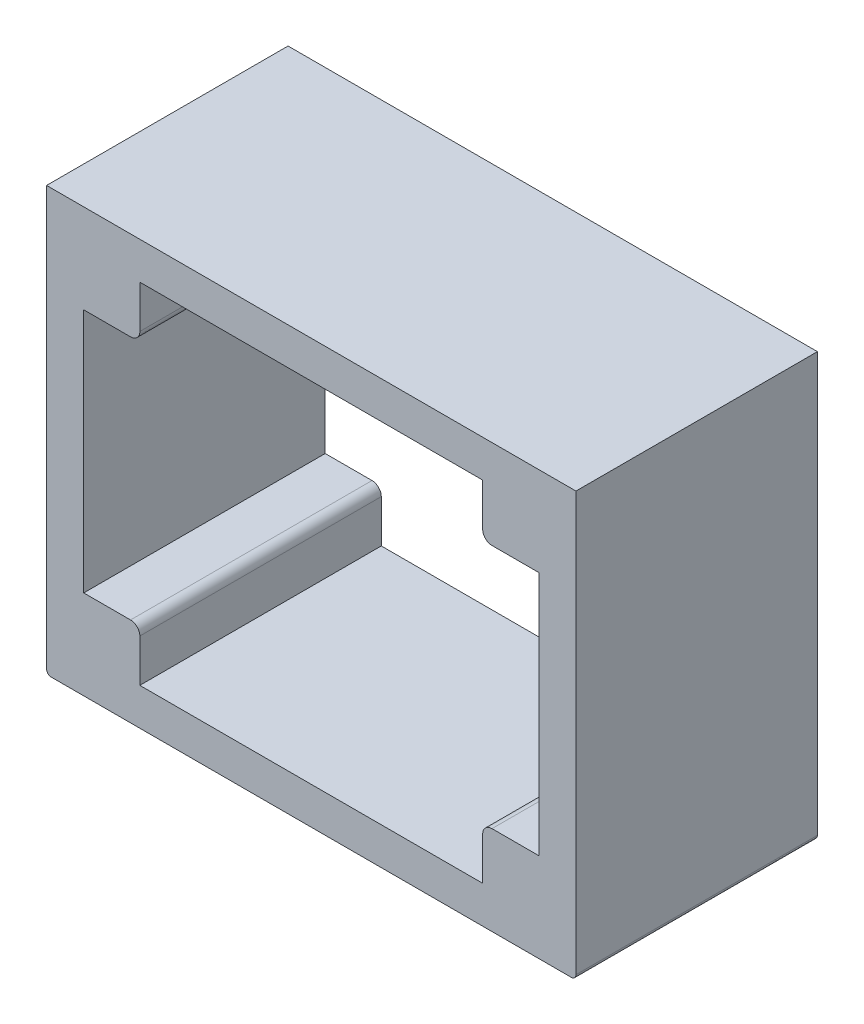
ISO-10303-21;
HEADER;
FILE_DESCRIPTION(('STEP AP214'),'2;1');
FILE_NAME('part.step','',(''),(''),'','','');
FILE_SCHEMA(('AUTOMOTIVE_DESIGN { 1 0 10303 214 1 1 1 1 }'));
ENDSEC;
DATA;
#1=APPLICATION_CONTEXT('core data for automotive mechanical design processes');
#2=APPLICATION_PROTOCOL_DEFINITION('international standard','automotive_design',2000,#1);
#3=PRODUCT_CONTEXT('',#1,'mechanical');
#4=PRODUCT('Part','Part','',(#3));
#5=PRODUCT_RELATED_PRODUCT_CATEGORY('part','',(#4));
#6=PRODUCT_DEFINITION_FORMATION('','',#4);
#7=PRODUCT_DEFINITION_CONTEXT('part definition',#1,'design');
#8=PRODUCT_DEFINITION('design','',#6,#7);
#9=PRODUCT_DEFINITION_SHAPE('','',#8);
#10=(LENGTH_UNIT() NAMED_UNIT(*) SI_UNIT(.MILLI.,.METRE.));
#11=(NAMED_UNIT(*) PLANE_ANGLE_UNIT() SI_UNIT($,.RADIAN.));
#12=(NAMED_UNIT(*) SI_UNIT($,.STERADIAN.) SOLID_ANGLE_UNIT());
#13=UNCERTAINTY_MEASURE_WITH_UNIT(LENGTH_MEASURE(1.E-05),#10,'distance_accuracy_value','');
#14=(GEOMETRIC_REPRESENTATION_CONTEXT(3) GLOBAL_UNCERTAINTY_ASSIGNED_CONTEXT((#13)) GLOBAL_UNIT_ASSIGNED_CONTEXT((#10,
#11,#12)) REPRESENTATION_CONTEXT('',''));
#15=CARTESIAN_POINT('',(0.,0.,0.));
#16=DIRECTION('',(0.,0.,1.));
#17=DIRECTION('',(1.,0.,0.));
#18=AXIS2_PLACEMENT_3D('',#15,#16,#17);
#19=CARTESIAN_POINT('',(-4.88949999999998,-143.192499999999,82.55));
#20=DIRECTION('',(0.,0.,1.));
#21=DIRECTION('',(1.,0.,0.));
#22=AXIS2_PLACEMENT_3D('',#19,#20,#21);
#23=PLANE('',#22);
#24=DIRECTION('',(0.,-1.,0.));
#25=VECTOR('',#24,1.);
#26=CARTESIAN_POINT('',(-6.47699999999994,1.01592686356331E-13,82.55));
#27=LINE('',#26,#25);
#28=CARTESIAN_POINT('',(-6.47699999999994,1.01592686356331E-13,82.55));
#29=VERTEX_POINT('',#28);
#30=CARTESIAN_POINT('',(-6.47699999999997,-143.192499999999,82.55));
#31=VERTEX_POINT('',#30);
#32=EDGE_CURVE('E332',#29,#31,#27,.T.);
#33=ORIENTED_EDGE('',*,*,#32,.T.);
#34=CARTESIAN_POINT('',(-4.88949999999998,-143.192499999999,82.55));
#35=DIRECTION('',(0.,0.,1.));
#36=DIRECTION('',(1.,0.,0.));
#37=AXIS2_PLACEMENT_3D('',#34,#35,#36);
#38=CIRCLE('',#37,1.58749999999999);
#39=CARTESIAN_POINT('',(-4.88949999999998,-144.779999999999,82.55));
#40=VERTEX_POINT('',#39);
#41=EDGE_CURVE('E336',#31,#40,#38,.T.);
#42=ORIENTED_EDGE('',*,*,#41,.T.);
#43=DIRECTION('',(1.,0.,0.));
#44=VECTOR('',#43,1.);
#45=CARTESIAN_POINT('',(-4.88949999999998,-144.779999999999,82.55));
#46=LINE('',#45,#44);
#47=CARTESIAN_POINT('',(172.9105,-144.779999999999,82.55));
#48=VERTEX_POINT('',#47);
#49=EDGE_CURVE('E339',#40,#48,#46,.T.);
#50=ORIENTED_EDGE('',*,*,#49,.T.);
#51=CARTESIAN_POINT('',(172.9105,-143.192499999999,82.55));
#52=DIRECTION('',(0.,0.,1.));
#53=DIRECTION('',(1.,0.,0.));
#54=AXIS2_PLACEMENT_3D('',#51,#52,#53);
#55=CIRCLE('',#54,1.58750000000001);
#56=CARTESIAN_POINT('',(174.498,-143.192499999999,82.55));
#57=VERTEX_POINT('',#56);
#58=EDGE_CURVE('E341',#48,#57,#55,.T.);
#59=ORIENTED_EDGE('',*,*,#58,.T.);
#60=DIRECTION('',(0.,1.,0.));
#61=VECTOR('',#60,1.);
#62=CARTESIAN_POINT('',(174.498,-143.192499999999,82.55));
#63=LINE('',#62,#61);
#64=CARTESIAN_POINT('',(174.498,1.04950770296597E-13,82.55));
#65=VERTEX_POINT('',#64);
#66=EDGE_CURVE('E343',#57,#65,#63,.T.);
#67=ORIENTED_EDGE('',*,*,#66,.T.);
#68=DIRECTION('',(-1.,0.,0.));
#69=VECTOR('',#68,1.);
#70=CARTESIAN_POINT('',(174.498,1.04950770296597E-13,82.55));
#71=LINE('',#70,#69);
#72=EDGE_CURVE('E345',#65,#29,#71,.T.);
#73=ORIENTED_EDGE('',*,*,#72,.T.);
#74=EDGE_LOOP('',(#33,#42,#50,#59,#67,#73));
#75=FACE_BOUND('',#74,.T.);
#76=DIRECTION('',(0.,-1.,0.));
#77=VECTOR('',#76,1.);
#78=CARTESIAN_POINT('',(25.4000000000353,-117.475,82.55));
#79=LINE('',#78,#77);
#80=CARTESIAN_POINT('',(25.4000000000353,-117.475,82.55));
#81=VERTEX_POINT('',#80);
#82=CARTESIAN_POINT('',(25.4000000000353,-132.079999999999,82.55));
#83=VERTEX_POINT('',#82);
#84=EDGE_CURVE('E203',#81,#83,#79,.T.);
#85=ORIENTED_EDGE('',*,*,#84,.F.);
#86=CARTESIAN_POINT('',(22.2250000000353,-117.475,82.55));
#87=DIRECTION('',(0.,0.,-1.));
#88=DIRECTION('',(1.,0.,0.));
#89=AXIS2_PLACEMENT_3D('',#86,#87,#88);
#90=CIRCLE('',#89,3.175);
#91=CARTESIAN_POINT('',(22.2250000000353,-114.3,82.55));
#92=VERTEX_POINT('',#91);
#93=EDGE_CURVE('E195',#92,#81,#90,.T.);
#94=ORIENTED_EDGE('',*,*,#93,.F.);
#95=DIRECTION('',(1.,0.,0.));
#96=VECTOR('',#95,1.);
#97=CARTESIAN_POINT('',(6.22300000000005,-114.3,82.55));
#98=LINE('',#97,#96);
#99=CARTESIAN_POINT('',(6.22300000000005,-114.3,82.55));
#100=VERTEX_POINT('',#99);
#101=EDGE_CURVE('E249',#100,#92,#98,.T.);
#102=ORIENTED_EDGE('',*,*,#101,.F.);
#103=DIRECTION('',(0.,-1.,0.));
#104=VECTOR('',#103,1.);
#105=CARTESIAN_POINT('',(6.22299999999998,-30.4799999999993,82.55));
#106=LINE('',#105,#104);
#107=CARTESIAN_POINT('',(6.22299999999998,-30.4799999999993,82.55));
#108=VERTEX_POINT('',#107);
#109=EDGE_CURVE('E246',#108,#100,#106,.T.);
#110=ORIENTED_EDGE('',*,*,#109,.F.);
#111=DIRECTION('',(-1.,0.,0.));
#112=VECTOR('',#111,1.);
#113=CARTESIAN_POINT('',(22.2250000000353,-30.4799999999993,82.55));
#114=LINE('',#113,#112);
#115=CARTESIAN_POINT('',(22.2250000000353,-30.4799999999993,82.55));
#116=VERTEX_POINT('',#115);
#117=EDGE_CURVE('E243',#116,#108,#114,.T.);
#118=ORIENTED_EDGE('',*,*,#117,.F.);
#119=CARTESIAN_POINT('',(22.2250000000353,-27.3049999999993,82.55));
#120=DIRECTION('',(0.,0.,-1.));
#121=DIRECTION('',(1.,0.,0.));
#122=AXIS2_PLACEMENT_3D('',#119,#120,#121);
#123=CIRCLE('',#122,3.175);
#124=CARTESIAN_POINT('',(25.4000000000353,-27.3049999999993,82.55));
#125=VERTEX_POINT('',#124);
#126=EDGE_CURVE('E240',#125,#116,#123,.T.);
#127=ORIENTED_EDGE('',*,*,#126,.F.);
#128=DIRECTION('',(0.,-1.,0.));
#129=VECTOR('',#128,1.);
#130=CARTESIAN_POINT('',(25.4000000000353,-12.6999999999999,82.55));
#131=LINE('',#130,#129);
#132=CARTESIAN_POINT('',(25.4000000000353,-12.6999999999999,82.55));
#133=VERTEX_POINT('',#132);
#134=EDGE_CURVE('E237',#133,#125,#131,.T.);
#135=ORIENTED_EDGE('',*,*,#134,.F.);
#136=DIRECTION('',(-1.,0.,0.));
#137=VECTOR('',#136,1.);
#138=CARTESIAN_POINT('',(142.620999999965,-12.6999999999999,82.55));
#139=LINE('',#138,#137);
#140=CARTESIAN_POINT('',(142.620999999965,-12.6999999999999,82.55));
#141=VERTEX_POINT('',#140);
#142=EDGE_CURVE('E234',#141,#133,#139,.T.);
#143=ORIENTED_EDGE('',*,*,#142,.F.);
#144=DIRECTION('',(0.,1.,0.));
#145=VECTOR('',#144,1.);
#146=CARTESIAN_POINT('',(142.620999999965,-27.3049999999993,82.55));
#147=LINE('',#146,#145);
#148=CARTESIAN_POINT('',(142.620999999965,-27.3049999999993,82.55));
#149=VERTEX_POINT('',#148);
#150=EDGE_CURVE('E232',#149,#141,#147,.T.);
#151=ORIENTED_EDGE('',*,*,#150,.F.);
#152=CARTESIAN_POINT('',(145.795999999965,-27.3049999999993,82.55));
#153=DIRECTION('',(0.,0.,-1.));
#154=DIRECTION('',(1.,0.,0.));
#155=AXIS2_PLACEMENT_3D('',#152,#153,#154);
#156=CIRCLE('',#155,3.17499999999999);
#157=CARTESIAN_POINT('',(145.795999999965,-30.4799999999993,82.55));
#158=VERTEX_POINT('',#157);
#159=EDGE_CURVE('E230',#158,#149,#156,.T.);
#160=ORIENTED_EDGE('',*,*,#159,.F.);
#161=DIRECTION('',(-1.,0.,0.));
#162=VECTOR('',#161,1.);
#163=CARTESIAN_POINT('',(161.798,-30.4799999999993,82.55));
#164=LINE('',#163,#162);
#165=CARTESIAN_POINT('',(161.798,-30.4799999999993,82.55));
#166=VERTEX_POINT('',#165);
#167=EDGE_CURVE('E228',#166,#158,#164,.T.);
#168=ORIENTED_EDGE('',*,*,#167,.F.);
#169=DIRECTION('',(0.,1.,0.));
#170=VECTOR('',#169,1.);
#171=CARTESIAN_POINT('',(161.798,-114.3,82.55));
#172=LINE('',#171,#170);
#173=CARTESIAN_POINT('',(161.798,-114.3,82.55));
#174=VERTEX_POINT('',#173);
#175=EDGE_CURVE('E226',#174,#166,#172,.T.);
#176=ORIENTED_EDGE('',*,*,#175,.F.);
#177=DIRECTION('',(1.,0.,0.));
#178=VECTOR('',#177,1.);
#179=CARTESIAN_POINT('',(145.795999999965,-114.3,82.55));
#180=LINE('',#179,#178);
#181=CARTESIAN_POINT('',(145.795999999965,-114.3,82.55));
#182=VERTEX_POINT('',#181);
#183=EDGE_CURVE('E224',#182,#174,#180,.T.);
#184=ORIENTED_EDGE('',*,*,#183,.F.);
#185=CARTESIAN_POINT('',(145.795999999965,-117.475,82.55));
#186=DIRECTION('',(0.,0.,-1.));
#187=DIRECTION('',(1.,0.,0.));
#188=AXIS2_PLACEMENT_3D('',#185,#186,#187);
#189=CIRCLE('',#188,3.17499999999999);
#190=CARTESIAN_POINT('',(142.620999999965,-117.475,82.55));
#191=VERTEX_POINT('',#190);
#192=EDGE_CURVE('E222',#191,#182,#189,.T.);
#193=ORIENTED_EDGE('',*,*,#192,.F.);
#194=DIRECTION('',(0.,1.,0.));
#195=VECTOR('',#194,1.);
#196=CARTESIAN_POINT('',(142.620999999965,-132.079999999999,82.55));
#197=LINE('',#196,#195);
#198=CARTESIAN_POINT('',(142.620999999965,-132.079999999999,82.55));
#199=VERTEX_POINT('',#198);
#200=EDGE_CURVE('E218',#199,#191,#197,.T.);
#201=ORIENTED_EDGE('',*,*,#200,.F.);
#202=DIRECTION('',(1.,0.,0.));
#203=VECTOR('',#202,1.);
#204=CARTESIAN_POINT('',(25.4000000000353,-132.079999999999,82.55));
#205=LINE('',#204,#203);
#206=EDGE_CURVE('E216',#83,#199,#205,.T.);
#207=ORIENTED_EDGE('',*,*,#206,.F.);
#208=EDGE_LOOP('',(#85,#94,#102,#110,#118,#127,#135,#143,#151,#160,#168,#176,#184,#193,#201,#207));
#209=FACE_BOUND('',#208,.T.);
#210=ADVANCED_FACE('F39',(#75,#209),#23,.T.);
#211=CARTESIAN_POINT('',(-4.88949999999998,-143.192499999999,0.));
#212=DIRECTION('',(0.,0.,1.));
#213=DIRECTION('',(1.,0.,0.));
#214=AXIS2_PLACEMENT_3D('',#211,#212,#213);
#215=PLANE('',#214);
#216=DIRECTION('',(0.,-1.,0.));
#217=VECTOR('',#216,1.);
#218=CARTESIAN_POINT('',(-6.47699999999994,1.01592686356331E-13,0.));
#219=LINE('',#218,#217);
#220=CARTESIAN_POINT('',(-6.47699999999994,1.01592686356331E-13,0.));
#221=VERTEX_POINT('',#220);
#222=CARTESIAN_POINT('',(-6.47699999999997,-143.192499999999,0.));
#223=VERTEX_POINT('',#222);
#224=EDGE_CURVE('E211',#221,#223,#219,.T.);
#225=ORIENTED_EDGE('',*,*,#224,.F.);
#226=DIRECTION('',(-1.,0.,0.));
#227=VECTOR('',#226,1.);
#228=CARTESIAN_POINT('',(174.498,1.04950770296597E-13,0.));
#229=LINE('',#228,#227);
#230=CARTESIAN_POINT('',(174.498,1.04950770296597E-13,0.));
#231=VERTEX_POINT('',#230);
#232=EDGE_CURVE('E337',#231,#221,#229,.T.);
#233=ORIENTED_EDGE('',*,*,#232,.F.);
#234=DIRECTION('',(0.,1.,0.));
#235=VECTOR('',#234,1.);
#236=CARTESIAN_POINT('',(174.498,-143.192499999999,0.));
#237=LINE('',#236,#235);
#238=CARTESIAN_POINT('',(174.498,-143.192499999999,0.));
#239=VERTEX_POINT('',#238);
#240=EDGE_CURVE('E358',#239,#231,#237,.T.);
#241=ORIENTED_EDGE('',*,*,#240,.F.);
#242=CARTESIAN_POINT('',(172.9105,-143.192499999999,0.));
#243=DIRECTION('',(0.,0.,1.));
#244=DIRECTION('',(1.,0.,0.));
#245=AXIS2_PLACEMENT_3D('',#242,#243,#244);
#246=CIRCLE('',#245,1.58750000000001);
#247=CARTESIAN_POINT('',(172.9105,-144.779999999999,0.));
#248=VERTEX_POINT('',#247);
#249=EDGE_CURVE('E356',#248,#239,#246,.T.);
#250=ORIENTED_EDGE('',*,*,#249,.F.);
#251=DIRECTION('',(1.,0.,0.));
#252=VECTOR('',#251,1.);
#253=CARTESIAN_POINT('',(-4.88949999999998,-144.779999999999,0.));
#254=LINE('',#253,#252);
#255=CARTESIAN_POINT('',(-4.88949999999998,-144.779999999999,0.));
#256=VERTEX_POINT('',#255);
#257=EDGE_CURVE('E354',#256,#248,#254,.T.);
#258=ORIENTED_EDGE('',*,*,#257,.F.);
#259=CARTESIAN_POINT('',(-4.88949999999998,-143.192499999999,0.));
#260=DIRECTION('',(0.,0.,1.));
#261=DIRECTION('',(1.,0.,0.));
#262=AXIS2_PLACEMENT_3D('',#259,#260,#261);
#263=CIRCLE('',#262,1.58749999999999);
#264=EDGE_CURVE('E352',#223,#256,#263,.T.);
#265=ORIENTED_EDGE('',*,*,#264,.F.);
#266=EDGE_LOOP('',(#225,#233,#241,#250,#258,#265));
#267=FACE_BOUND('',#266,.T.);
#268=CARTESIAN_POINT('',(22.2250000000353,-117.475,0.));
#269=DIRECTION('',(0.,0.,-1.));
#270=DIRECTION('',(1.,0.,0.));
#271=AXIS2_PLACEMENT_3D('',#268,#269,#270);
#272=CIRCLE('',#271,3.175);
#273=CARTESIAN_POINT('',(22.2250000000353,-114.3,0.));
#274=VERTEX_POINT('',#273);
#275=CARTESIAN_POINT('',(25.4000000000353,-117.475,0.));
#276=VERTEX_POINT('',#275);
#277=EDGE_CURVE('E62',#274,#276,#272,.T.);
#278=ORIENTED_EDGE('',*,*,#277,.T.);
#279=DIRECTION('',(0.,-1.,0.));
#280=VECTOR('',#279,1.);
#281=CARTESIAN_POINT('',(25.4000000000353,-117.475,0.));
#282=LINE('',#281,#280);
#283=CARTESIAN_POINT('',(25.4000000000353,-132.079999999999,0.));
#284=VERTEX_POINT('',#283);
#285=EDGE_CURVE('E210',#276,#284,#282,.T.);
#286=ORIENTED_EDGE('',*,*,#285,.T.);
#287=DIRECTION('',(1.,0.,0.));
#288=VECTOR('',#287,1.);
#289=CARTESIAN_POINT('',(25.4000000000353,-132.079999999999,0.));
#290=LINE('',#289,#288);
#291=CARTESIAN_POINT('',(142.620999999965,-132.079999999999,0.));
#292=VERTEX_POINT('',#291);
#293=EDGE_CURVE('E253',#284,#292,#290,.T.);
#294=ORIENTED_EDGE('',*,*,#293,.T.);
#295=DIRECTION('',(0.,1.,0.));
#296=VECTOR('',#295,1.);
#297=CARTESIAN_POINT('',(142.620999999965,-132.079999999999,0.));
#298=LINE('',#297,#296);
#299=CARTESIAN_POINT('',(142.620999999965,-117.475,0.));
#300=VERTEX_POINT('',#299);
#301=EDGE_CURVE('E256',#292,#300,#298,.T.);
#302=ORIENTED_EDGE('',*,*,#301,.T.);
#303=CARTESIAN_POINT('',(145.795999999965,-117.475,0.));
#304=DIRECTION('',(0.,0.,-1.));
#305=DIRECTION('',(1.,0.,0.));
#306=AXIS2_PLACEMENT_3D('',#303,#304,#305);
#307=CIRCLE('',#306,3.17499999999999);
#308=CARTESIAN_POINT('',(145.795999999965,-114.3,0.));
#309=VERTEX_POINT('',#308);
#310=EDGE_CURVE('E259',#300,#309,#307,.T.);
#311=ORIENTED_EDGE('',*,*,#310,.T.);
#312=DIRECTION('',(1.,0.,0.));
#313=VECTOR('',#312,1.);
#314=CARTESIAN_POINT('',(145.795999999965,-114.3,0.));
#315=LINE('',#314,#313);
#316=CARTESIAN_POINT('',(161.798,-114.3,0.));
#317=VERTEX_POINT('',#316);
#318=EDGE_CURVE('E262',#309,#317,#315,.T.);
#319=ORIENTED_EDGE('',*,*,#318,.T.);
#320=DIRECTION('',(0.,1.,0.));
#321=VECTOR('',#320,1.);
#322=CARTESIAN_POINT('',(161.798,-114.3,0.));
#323=LINE('',#322,#321);
#324=CARTESIAN_POINT('',(161.798,-30.4799999999993,0.));
#325=VERTEX_POINT('',#324);
#326=EDGE_CURVE('E265',#317,#325,#323,.T.);
#327=ORIENTED_EDGE('',*,*,#326,.T.);
#328=DIRECTION('',(-1.,0.,0.));
#329=VECTOR('',#328,1.);
#330=CARTESIAN_POINT('',(161.798,-30.4799999999993,0.));
#331=LINE('',#330,#329);
#332=CARTESIAN_POINT('',(145.795999999965,-30.4799999999993,0.));
#333=VERTEX_POINT('',#332);
#334=EDGE_CURVE('E269',#325,#333,#331,.T.);
#335=ORIENTED_EDGE('',*,*,#334,.T.);
#336=CARTESIAN_POINT('',(145.795999999965,-27.3049999999993,0.));
#337=DIRECTION('',(0.,0.,-1.));
#338=DIRECTION('',(1.,0.,0.));
#339=AXIS2_PLACEMENT_3D('',#336,#337,#338);
#340=CIRCLE('',#339,3.17499999999999);
#341=CARTESIAN_POINT('',(142.620999999965,-27.3049999999993,0.));
#342=VERTEX_POINT('',#341);
#343=EDGE_CURVE('E272',#333,#342,#340,.T.);
#344=ORIENTED_EDGE('',*,*,#343,.T.);
#345=DIRECTION('',(0.,1.,0.));
#346=VECTOR('',#345,1.);
#347=CARTESIAN_POINT('',(142.620999999965,-27.3049999999993,0.));
#348=LINE('',#347,#346);
#349=CARTESIAN_POINT('',(142.620999999965,-12.6999999999999,0.));
#350=VERTEX_POINT('',#349);
#351=EDGE_CURVE('E275',#342,#350,#348,.T.);
#352=ORIENTED_EDGE('',*,*,#351,.T.);
#353=DIRECTION('',(-1.,0.,0.));
#354=VECTOR('',#353,1.);
#355=CARTESIAN_POINT('',(142.620999999965,-12.6999999999999,0.));
#356=LINE('',#355,#354);
#357=CARTESIAN_POINT('',(25.4000000000353,-12.6999999999999,0.));
#358=VERTEX_POINT('',#357);
#359=EDGE_CURVE('E278',#350,#358,#356,.T.);
#360=ORIENTED_EDGE('',*,*,#359,.T.);
#361=DIRECTION('',(0.,-1.,0.));
#362=VECTOR('',#361,1.);
#363=CARTESIAN_POINT('',(25.4000000000353,-12.6999999999999,0.));
#364=LINE('',#363,#362);
#365=CARTESIAN_POINT('',(25.4000000000353,-27.3049999999993,0.));
#366=VERTEX_POINT('',#365);
#367=EDGE_CURVE('E282',#358,#366,#364,.T.);
#368=ORIENTED_EDGE('',*,*,#367,.T.);
#369=CARTESIAN_POINT('',(22.2250000000353,-27.3049999999993,0.));
#370=DIRECTION('',(0.,0.,-1.));
#371=DIRECTION('',(1.,0.,0.));
#372=AXIS2_PLACEMENT_3D('',#369,#370,#371);
#373=CIRCLE('',#372,3.175);
#374=CARTESIAN_POINT('',(22.2250000000353,-30.4799999999993,0.));
#375=VERTEX_POINT('',#374);
#376=EDGE_CURVE('E286',#366,#375,#373,.T.);
#377=ORIENTED_EDGE('',*,*,#376,.T.);
#378=DIRECTION('',(-1.,0.,0.));
#379=VECTOR('',#378,1.);
#380=CARTESIAN_POINT('',(22.2250000000353,-30.4799999999993,0.));
#381=LINE('',#380,#379);
#382=CARTESIAN_POINT('',(6.22299999999998,-30.4799999999993,0.));
#383=VERTEX_POINT('',#382);
#384=EDGE_CURVE('E290',#375,#383,#381,.T.);
#385=ORIENTED_EDGE('',*,*,#384,.T.);
#386=DIRECTION('',(0.,-1.,0.));
#387=VECTOR('',#386,1.);
#388=CARTESIAN_POINT('',(6.22299999999998,-30.4799999999993,0.));
#389=LINE('',#388,#387);
#390=CARTESIAN_POINT('',(6.22300000000005,-114.3,0.));
#391=VERTEX_POINT('',#390);
#392=EDGE_CURVE('E294',#383,#391,#389,.T.);
#393=ORIENTED_EDGE('',*,*,#392,.T.);
#394=DIRECTION('',(1.,0.,0.));
#395=VECTOR('',#394,1.);
#396=CARTESIAN_POINT('',(6.22300000000005,-114.3,0.));
#397=LINE('',#396,#395);
#398=EDGE_CURVE('E204',#391,#274,#397,.T.);
#399=ORIENTED_EDGE('',*,*,#398,.T.);
#400=EDGE_LOOP('',(#278,#286,#294,#302,#311,#319,#327,#335,#344,#352,#360,#368,#377,#385,#393,#399));
#401=FACE_BOUND('',#400,.T.);
#402=ADVANCED_FACE('F386',(#267,#401),#215,.F.);
#403=CARTESIAN_POINT('',(-6.47699999999994,1.01592686356331E-13,82.55));
#404=DIRECTION('',(1.,0.,0.));
#405=DIRECTION('',(0.,1.,0.));
#406=AXIS2_PLACEMENT_3D('',#403,#404,#405);
#407=PLANE('',#406);
#408=ORIENTED_EDGE('',*,*,#224,.T.);
#409=DIRECTION('',(0.,0.,-1.));
#410=VECTOR('',#409,1.);
#411=CARTESIAN_POINT('',(-6.47699999999997,-143.192499999999,82.55));
#412=LINE('',#411,#410);
#413=EDGE_CURVE('E11',#31,#223,#412,.T.);
#414=ORIENTED_EDGE('',*,*,#413,.F.);
#415=ORIENTED_EDGE('',*,*,#32,.F.);
#416=DIRECTION('',(0.,0.,-1.));
#417=VECTOR('',#416,1.);
#418=CARTESIAN_POINT('',(-6.47699999999994,1.01592686356331E-13,82.55));
#419=LINE('',#418,#417);
#420=EDGE_CURVE('E348',#29,#221,#419,.T.);
#421=ORIENTED_EDGE('',*,*,#420,.T.);
#422=EDGE_LOOP('',(#408,#414,#415,#421));
#423=FACE_BOUND('',#422,.T.);
#424=ADVANCED_FACE('F41',(#423),#407,.F.);
#425=CARTESIAN_POINT('',(-4.88949999999998,-143.192499999999,82.55));
#426=DIRECTION('',(0.,0.,-1.));
#427=DIRECTION('',(-1.,0.,0.));
#428=AXIS2_PLACEMENT_3D('',#425,#426,#427);
#429=CYLINDRICAL_SURFACE('',#428,1.58749999999999);
#430=ORIENTED_EDGE('',*,*,#264,.T.);
#431=DIRECTION('',(0.,0.,-1.));
#432=VECTOR('',#431,1.);
#433=CARTESIAN_POINT('',(-4.88949999999998,-144.779999999999,82.55));
#434=LINE('',#433,#432);
#435=EDGE_CURVE('E47',#40,#256,#434,.T.);
#436=ORIENTED_EDGE('',*,*,#435,.F.);
#437=ORIENTED_EDGE('',*,*,#41,.F.);
#438=ORIENTED_EDGE('',*,*,#413,.T.);
#439=EDGE_LOOP('',(#430,#436,#437,#438));
#440=FACE_BOUND('',#439,.T.);
#441=ADVANCED_FACE('F403',(#440),#429,.T.);
#442=CARTESIAN_POINT('',(-4.88949999999998,-144.779999999999,82.55));
#443=DIRECTION('',(0.,1.,0.));
#444=DIRECTION('',(-1.,0.,0.));
#445=AXIS2_PLACEMENT_3D('',#442,#443,#444);
#446=PLANE('',#445);
#447=ORIENTED_EDGE('',*,*,#257,.T.);
#448=DIRECTION('',(0.,0.,-1.));
#449=VECTOR('',#448,1.);
#450=CARTESIAN_POINT('',(172.9105,-144.779999999999,82.55));
#451=LINE('',#450,#449);
#452=EDGE_CURVE('E372',#48,#248,#451,.T.);
#453=ORIENTED_EDGE('',*,*,#452,.F.);
#454=ORIENTED_EDGE('',*,*,#49,.F.);
#455=ORIENTED_EDGE('',*,*,#435,.T.);
#456=EDGE_LOOP('',(#447,#453,#454,#455));
#457=FACE_BOUND('',#456,.T.);
#458=ADVANCED_FACE('F380',(#457),#446,.F.);
#459=CARTESIAN_POINT('',(172.9105,-143.192499999999,82.55));
#460=DIRECTION('',(0.,0.,-1.));
#461=DIRECTION('',(-1.,0.,0.));
#462=AXIS2_PLACEMENT_3D('',#459,#460,#461);
#463=CYLINDRICAL_SURFACE('',#462,1.58750000000001);
#464=ORIENTED_EDGE('',*,*,#249,.T.);
#465=DIRECTION('',(0.,0.,-1.));
#466=VECTOR('',#465,1.);
#467=CARTESIAN_POINT('',(174.498,-143.192499999999,82.55));
#468=LINE('',#467,#466);
#469=EDGE_CURVE('E368',#57,#239,#468,.T.);
#470=ORIENTED_EDGE('',*,*,#469,.F.);
#471=ORIENTED_EDGE('',*,*,#58,.F.);
#472=ORIENTED_EDGE('',*,*,#452,.T.);
#473=EDGE_LOOP('',(#464,#470,#471,#472));
#474=FACE_BOUND('',#473,.T.);
#475=ADVANCED_FACE('F392',(#474),#463,.T.);
#476=CARTESIAN_POINT('',(174.498,-143.192499999999,82.55));
#477=DIRECTION('',(-1.,0.,0.));
#478=DIRECTION('',(0.,-1.,0.));
#479=AXIS2_PLACEMENT_3D('',#476,#477,#478);
#480=PLANE('',#479);
#481=ORIENTED_EDGE('',*,*,#240,.T.);
#482=DIRECTION('',(0.,0.,-1.));
#483=VECTOR('',#482,1.);
#484=CARTESIAN_POINT('',(174.498,1.04950770296597E-13,82.55));
#485=LINE('',#484,#483);
#486=EDGE_CURVE('E365',#65,#231,#485,.T.);
#487=ORIENTED_EDGE('',*,*,#486,.F.);
#488=ORIENTED_EDGE('',*,*,#66,.F.);
#489=ORIENTED_EDGE('',*,*,#469,.T.);
#490=EDGE_LOOP('',(#481,#487,#488,#489));
#491=FACE_BOUND('',#490,.T.);
#492=ADVANCED_FACE('F396',(#491),#480,.F.);
#493=CARTESIAN_POINT('',(174.498,1.04950770296597E-13,82.55));
#494=DIRECTION('',(0.,-1.,0.));
#495=DIRECTION('',(1.,0.,0.));
#496=AXIS2_PLACEMENT_3D('',#493,#494,#495);
#497=PLANE('',#496);
#498=ORIENTED_EDGE('',*,*,#232,.T.);
#499=ORIENTED_EDGE('',*,*,#420,.F.);
#500=ORIENTED_EDGE('',*,*,#72,.F.);
#501=ORIENTED_EDGE('',*,*,#486,.T.);
#502=EDGE_LOOP('',(#498,#499,#500,#501));
#503=FACE_BOUND('',#502,.T.);
#504=ADVANCED_FACE('F406',(#503),#497,.F.);
#505=CARTESIAN_POINT('',(22.2250000000353,-117.475,82.55));
#506=DIRECTION('',(0.,0.,-1.));
#507=DIRECTION('',(-1.,0.,0.));
#508=AXIS2_PLACEMENT_3D('',#505,#506,#507);
#509=CYLINDRICAL_SURFACE('',#508,3.175);
#510=ORIENTED_EDGE('',*,*,#277,.F.);
#511=DIRECTION('',(0.,0.,-1.));
#512=VECTOR('',#511,1.);
#513=CARTESIAN_POINT('',(22.2250000000353,-114.3,82.55));
#514=LINE('',#513,#512);
#515=EDGE_CURVE('E199',#92,#274,#514,.T.);
#516=ORIENTED_EDGE('',*,*,#515,.F.);
#517=ORIENTED_EDGE('',*,*,#93,.T.);
#518=DIRECTION('',(0.,0.,-1.));
#519=VECTOR('',#518,1.);
#520=CARTESIAN_POINT('',(25.4000000000353,-117.475,82.55));
#521=LINE('',#520,#519);
#522=EDGE_CURVE('E198',#81,#276,#521,.T.);
#523=ORIENTED_EDGE('',*,*,#522,.T.);
#524=EDGE_LOOP('',(#510,#516,#517,#523));
#525=FACE_BOUND('',#524,.T.);
#526=ADVANCED_FACE('F197',(#525),#509,.T.);
#527=CARTESIAN_POINT('',(25.4000000000353,-117.475,82.55));
#528=DIRECTION('',(1.,0.,0.));
#529=DIRECTION('',(0.,1.,0.));
#530=AXIS2_PLACEMENT_3D('',#527,#528,#529);
#531=PLANE('',#530);
#532=ORIENTED_EDGE('',*,*,#285,.F.);
#533=ORIENTED_EDGE('',*,*,#522,.F.);
#534=ORIENTED_EDGE('',*,*,#84,.T.);
#535=DIRECTION('',(0.,0.,-1.));
#536=VECTOR('',#535,1.);
#537=CARTESIAN_POINT('',(25.4000000000353,-132.079999999999,82.55));
#538=LINE('',#537,#536);
#539=EDGE_CURVE('E212',#83,#284,#538,.T.);
#540=ORIENTED_EDGE('',*,*,#539,.T.);
#541=EDGE_LOOP('',(#532,#533,#534,#540));
#542=FACE_BOUND('',#541,.T.);
#543=ADVANCED_FACE('F207',(#542),#531,.T.);
#544=CARTESIAN_POINT('',(25.4000000000353,-132.079999999999,82.55));
#545=DIRECTION('',(0.,1.,0.));
#546=DIRECTION('',(-1.,0.,0.));
#547=AXIS2_PLACEMENT_3D('',#544,#545,#546);
#548=PLANE('',#547);
#549=ORIENTED_EDGE('',*,*,#293,.F.);
#550=ORIENTED_EDGE('',*,*,#539,.F.);
#551=ORIENTED_EDGE('',*,*,#206,.T.);
#552=DIRECTION('',(0.,0.,-1.));
#553=VECTOR('',#552,1.);
#554=CARTESIAN_POINT('',(142.620999999965,-132.079999999999,82.55));
#555=LINE('',#554,#553);
#556=EDGE_CURVE('E329',#199,#292,#555,.T.);
#557=ORIENTED_EDGE('',*,*,#556,.T.);
#558=EDGE_LOOP('',(#549,#550,#551,#557));
#559=FACE_BOUND('',#558,.T.);
#560=ADVANCED_FACE('F424',(#559),#548,.T.);
#561=CARTESIAN_POINT('',(142.620999999965,-132.079999999999,82.55));
#562=DIRECTION('',(-1.,0.,0.));
#563=DIRECTION('',(0.,0.,1.));
#564=AXIS2_PLACEMENT_3D('',#561,#562,#563);
#565=PLANE('',#564);
#566=ORIENTED_EDGE('',*,*,#301,.F.);
#567=ORIENTED_EDGE('',*,*,#556,.F.);
#568=ORIENTED_EDGE('',*,*,#200,.T.);
#569=DIRECTION('',(0.,0.,-1.));
#570=VECTOR('',#569,1.);
#571=CARTESIAN_POINT('',(142.620999999965,-117.475,82.55));
#572=LINE('',#571,#570);
#573=EDGE_CURVE('E327',#191,#300,#572,.T.);
#574=ORIENTED_EDGE('',*,*,#573,.T.);
#575=EDGE_LOOP('',(#566,#567,#568,#574));
#576=FACE_BOUND('',#575,.T.);
#577=ADVANCED_FACE('F427',(#576),#565,.T.);
#578=CARTESIAN_POINT('',(145.795999999965,-117.475,82.55));
#579=DIRECTION('',(0.,0.,-1.));
#580=DIRECTION('',(-1.,0.,0.));
#581=AXIS2_PLACEMENT_3D('',#578,#579,#580);
#582=CYLINDRICAL_SURFACE('',#581,3.17499999999999);
#583=ORIENTED_EDGE('',*,*,#310,.F.);
#584=ORIENTED_EDGE('',*,*,#573,.F.);
#585=ORIENTED_EDGE('',*,*,#192,.T.);
#586=DIRECTION('',(0.,0.,-1.));
#587=VECTOR('',#586,1.);
#588=CARTESIAN_POINT('',(145.795999999965,-114.3,82.55));
#589=LINE('',#588,#587);
#590=EDGE_CURVE('E325',#182,#309,#589,.T.);
#591=ORIENTED_EDGE('',*,*,#590,.T.);
#592=EDGE_LOOP('',(#583,#584,#585,#591));
#593=FACE_BOUND('',#592,.T.);
#594=ADVANCED_FACE('F431',(#593),#582,.T.);
#595=CARTESIAN_POINT('',(145.795999999965,-114.3,82.55));
#596=DIRECTION('',(0.,1.,0.));
#597=DIRECTION('',(-1.,0.,0.));
#598=AXIS2_PLACEMENT_3D('',#595,#596,#597);
#599=PLANE('',#598);
#600=ORIENTED_EDGE('',*,*,#318,.F.);
#601=ORIENTED_EDGE('',*,*,#590,.F.);
#602=ORIENTED_EDGE('',*,*,#183,.T.);
#603=DIRECTION('',(0.,0.,-1.));
#604=VECTOR('',#603,1.);
#605=CARTESIAN_POINT('',(161.798,-114.3,82.55));
#606=LINE('',#605,#604);
#607=EDGE_CURVE('E322',#174,#317,#606,.T.);
#608=ORIENTED_EDGE('',*,*,#607,.T.);
#609=EDGE_LOOP('',(#600,#601,#602,#608));
#610=FACE_BOUND('',#609,.T.);
#611=ADVANCED_FACE('F435',(#610),#599,.T.);
#612=CARTESIAN_POINT('',(161.798,-114.3,82.55));
#613=DIRECTION('',(-1.,0.,0.));
#614=DIRECTION('',(0.,0.,1.));
#615=AXIS2_PLACEMENT_3D('',#612,#613,#614);
#616=PLANE('',#615);
#617=ORIENTED_EDGE('',*,*,#326,.F.);
#618=ORIENTED_EDGE('',*,*,#607,.F.);
#619=ORIENTED_EDGE('',*,*,#175,.T.);
#620=DIRECTION('',(0.,0.,-1.));
#621=VECTOR('',#620,1.);
#622=CARTESIAN_POINT('',(161.798,-30.4799999999993,82.55));
#623=LINE('',#622,#621);
#624=EDGE_CURVE('E320',#166,#325,#623,.T.);
#625=ORIENTED_EDGE('',*,*,#624,.T.);
#626=EDGE_LOOP('',(#617,#618,#619,#625));
#627=FACE_BOUND('',#626,.T.);
#628=ADVANCED_FACE('F439',(#627),#616,.T.);
#629=CARTESIAN_POINT('',(161.798,-30.4799999999993,82.55));
#630=DIRECTION('',(0.,-1.,0.));
#631=DIRECTION('',(1.,0.,0.));
#632=AXIS2_PLACEMENT_3D('',#629,#630,#631);
#633=PLANE('',#632);
#634=ORIENTED_EDGE('',*,*,#334,.F.);
#635=ORIENTED_EDGE('',*,*,#624,.F.);
#636=ORIENTED_EDGE('',*,*,#167,.T.);
#637=DIRECTION('',(0.,0.,-1.));
#638=VECTOR('',#637,1.);
#639=CARTESIAN_POINT('',(145.795999999965,-30.4799999999993,82.55));
#640=LINE('',#639,#638);
#641=EDGE_CURVE('E318',#158,#333,#640,.T.);
#642=ORIENTED_EDGE('',*,*,#641,.T.);
#643=EDGE_LOOP('',(#634,#635,#636,#642));
#644=FACE_BOUND('',#643,.T.);
#645=ADVANCED_FACE('F443',(#644),#633,.T.);
#646=CARTESIAN_POINT('',(145.795999999965,-27.3049999999993,82.55));
#647=DIRECTION('',(0.,0.,-1.));
#648=DIRECTION('',(-1.,0.,0.));
#649=AXIS2_PLACEMENT_3D('',#646,#647,#648);
#650=CYLINDRICAL_SURFACE('',#649,3.17499999999999);
#651=ORIENTED_EDGE('',*,*,#343,.F.);
#652=ORIENTED_EDGE('',*,*,#641,.F.);
#653=ORIENTED_EDGE('',*,*,#159,.T.);
#654=DIRECTION('',(0.,0.,-1.));
#655=VECTOR('',#654,1.);
#656=CARTESIAN_POINT('',(142.620999999965,-27.3049999999993,82.55));
#657=LINE('',#656,#655);
#658=EDGE_CURVE('E316',#149,#342,#657,.T.);
#659=ORIENTED_EDGE('',*,*,#658,.T.);
#660=EDGE_LOOP('',(#651,#652,#653,#659));
#661=FACE_BOUND('',#660,.T.);
#662=ADVANCED_FACE('F447',(#661),#650,.T.);
#663=CARTESIAN_POINT('',(142.620999999965,-27.3049999999993,82.55));
#664=DIRECTION('',(-1.,0.,0.));
#665=DIRECTION('',(0.,0.,1.));
#666=AXIS2_PLACEMENT_3D('',#663,#664,#665);
#667=PLANE('',#666);
#668=ORIENTED_EDGE('',*,*,#351,.F.);
#669=ORIENTED_EDGE('',*,*,#658,.F.);
#670=ORIENTED_EDGE('',*,*,#150,.T.);
#671=DIRECTION('',(0.,0.,-1.));
#672=VECTOR('',#671,1.);
#673=CARTESIAN_POINT('',(142.620999999965,-12.6999999999999,82.55));
#674=LINE('',#673,#672);
#675=EDGE_CURVE('E314',#141,#350,#674,.T.);
#676=ORIENTED_EDGE('',*,*,#675,.T.);
#677=EDGE_LOOP('',(#668,#669,#670,#676));
#678=FACE_BOUND('',#677,.T.);
#679=ADVANCED_FACE('F451',(#678),#667,.T.);
#680=CARTESIAN_POINT('',(142.620999999965,-12.6999999999999,82.55));
#681=DIRECTION('',(0.,-1.,0.));
#682=DIRECTION('',(1.,0.,0.));
#683=AXIS2_PLACEMENT_3D('',#680,#681,#682);
#684=PLANE('',#683);
#685=ORIENTED_EDGE('',*,*,#359,.F.);
#686=ORIENTED_EDGE('',*,*,#675,.F.);
#687=ORIENTED_EDGE('',*,*,#142,.T.);
#688=DIRECTION('',(0.,0.,-1.));
#689=VECTOR('',#688,1.);
#690=CARTESIAN_POINT('',(25.4000000000353,-12.6999999999999,82.55));
#691=LINE('',#690,#689);
#692=EDGE_CURVE('E311',#133,#358,#691,.T.);
#693=ORIENTED_EDGE('',*,*,#692,.T.);
#694=EDGE_LOOP('',(#685,#686,#687,#693));
#695=FACE_BOUND('',#694,.T.);
#696=ADVANCED_FACE('F455',(#695),#684,.T.);
#697=CARTESIAN_POINT('',(25.4000000000353,-12.6999999999999,82.55));
#698=DIRECTION('',(1.,0.,0.));
#699=DIRECTION('',(0.,1.,0.));
#700=AXIS2_PLACEMENT_3D('',#697,#698,#699);
#701=PLANE('',#700);
#702=ORIENTED_EDGE('',*,*,#367,.F.);
#703=ORIENTED_EDGE('',*,*,#692,.F.);
#704=ORIENTED_EDGE('',*,*,#134,.T.);
#705=DIRECTION('',(0.,0.,-1.));
#706=VECTOR('',#705,1.);
#707=CARTESIAN_POINT('',(25.4000000000353,-27.3049999999993,82.55));
#708=LINE('',#707,#706);
#709=EDGE_CURVE('E308',#125,#366,#708,.T.);
#710=ORIENTED_EDGE('',*,*,#709,.T.);
#711=EDGE_LOOP('',(#702,#703,#704,#710));
#712=FACE_BOUND('',#711,.T.);
#713=ADVANCED_FACE('F459',(#712),#701,.T.);
#714=CARTESIAN_POINT('',(22.2250000000353,-27.3049999999993,82.55));
#715=DIRECTION('',(0.,0.,-1.));
#716=DIRECTION('',(-1.,0.,0.));
#717=AXIS2_PLACEMENT_3D('',#714,#715,#716);
#718=CYLINDRICAL_SURFACE('',#717,3.175);
#719=ORIENTED_EDGE('',*,*,#376,.F.);
#720=ORIENTED_EDGE('',*,*,#709,.F.);
#721=ORIENTED_EDGE('',*,*,#126,.T.);
#722=DIRECTION('',(0.,0.,-1.));
#723=VECTOR('',#722,1.);
#724=CARTESIAN_POINT('',(22.2250000000353,-30.4799999999993,82.55));
#725=LINE('',#724,#723);
#726=EDGE_CURVE('E305',#116,#375,#725,.T.);
#727=ORIENTED_EDGE('',*,*,#726,.T.);
#728=EDGE_LOOP('',(#719,#720,#721,#727));
#729=FACE_BOUND('',#728,.T.);
#730=ADVANCED_FACE('F463',(#729),#718,.T.);
#731=CARTESIAN_POINT('',(22.2250000000353,-30.4799999999993,82.55));
#732=DIRECTION('',(0.,-1.,0.));
#733=DIRECTION('',(1.,0.,0.));
#734=AXIS2_PLACEMENT_3D('',#731,#732,#733);
#735=PLANE('',#734);
#736=ORIENTED_EDGE('',*,*,#384,.F.);
#737=ORIENTED_EDGE('',*,*,#726,.F.);
#738=ORIENTED_EDGE('',*,*,#117,.T.);
#739=DIRECTION('',(0.,0.,-1.));
#740=VECTOR('',#739,1.);
#741=CARTESIAN_POINT('',(6.22299999999998,-30.4799999999993,82.55));
#742=LINE('',#741,#740);
#743=EDGE_CURVE('E302',#108,#383,#742,.T.);
#744=ORIENTED_EDGE('',*,*,#743,.T.);
#745=EDGE_LOOP('',(#736,#737,#738,#744));
#746=FACE_BOUND('',#745,.T.);
#747=ADVANCED_FACE('F467',(#746),#735,.T.);
#748=CARTESIAN_POINT('',(6.22299999999998,-30.4799999999993,82.55));
#749=DIRECTION('',(1.,0.,0.));
#750=DIRECTION('',(0.,1.,0.));
#751=AXIS2_PLACEMENT_3D('',#748,#749,#750);
#752=PLANE('',#751);
#753=ORIENTED_EDGE('',*,*,#392,.F.);
#754=ORIENTED_EDGE('',*,*,#743,.F.);
#755=ORIENTED_EDGE('',*,*,#109,.T.);
#756=DIRECTION('',(0.,0.,-1.));
#757=VECTOR('',#756,1.);
#758=CARTESIAN_POINT('',(6.22300000000005,-114.3,82.55));
#759=LINE('',#758,#757);
#760=EDGE_CURVE('E54',#100,#391,#759,.T.);
#761=ORIENTED_EDGE('',*,*,#760,.T.);
#762=EDGE_LOOP('',(#753,#754,#755,#761));
#763=FACE_BOUND('',#762,.T.);
#764=ADVANCED_FACE('F471',(#763),#752,.T.);
#765=CARTESIAN_POINT('',(6.22300000000005,-114.3,82.55));
#766=DIRECTION('',(0.,1.,0.));
#767=DIRECTION('',(-1.,0.,0.));
#768=AXIS2_PLACEMENT_3D('',#765,#766,#767);
#769=PLANE('',#768);
#770=ORIENTED_EDGE('',*,*,#398,.F.);
#771=ORIENTED_EDGE('',*,*,#760,.F.);
#772=ORIENTED_EDGE('',*,*,#101,.T.);
#773=ORIENTED_EDGE('',*,*,#515,.T.);
#774=EDGE_LOOP('',(#770,#771,#772,#773));
#775=FACE_BOUND('',#774,.T.);
#776=ADVANCED_FACE('F475',(#775),#769,.T.);
#777=CLOSED_SHELL('',(#210,#402,#424,#441,#458,#475,#492,#504,#526,#543,#560,#577,#594,#611,
#628,#645,#662,#679,#696,#713,#730,#747,#764,#776));
#778=MANIFOLD_SOLID_BREP('B2',#777);
#779=ADVANCED_BREP_SHAPE_REPRESENTATION('',(#18,#778),#14);
#780=SHAPE_DEFINITION_REPRESENTATION(#9,#779);
ENDSEC;
END-ISO-10303-21;
